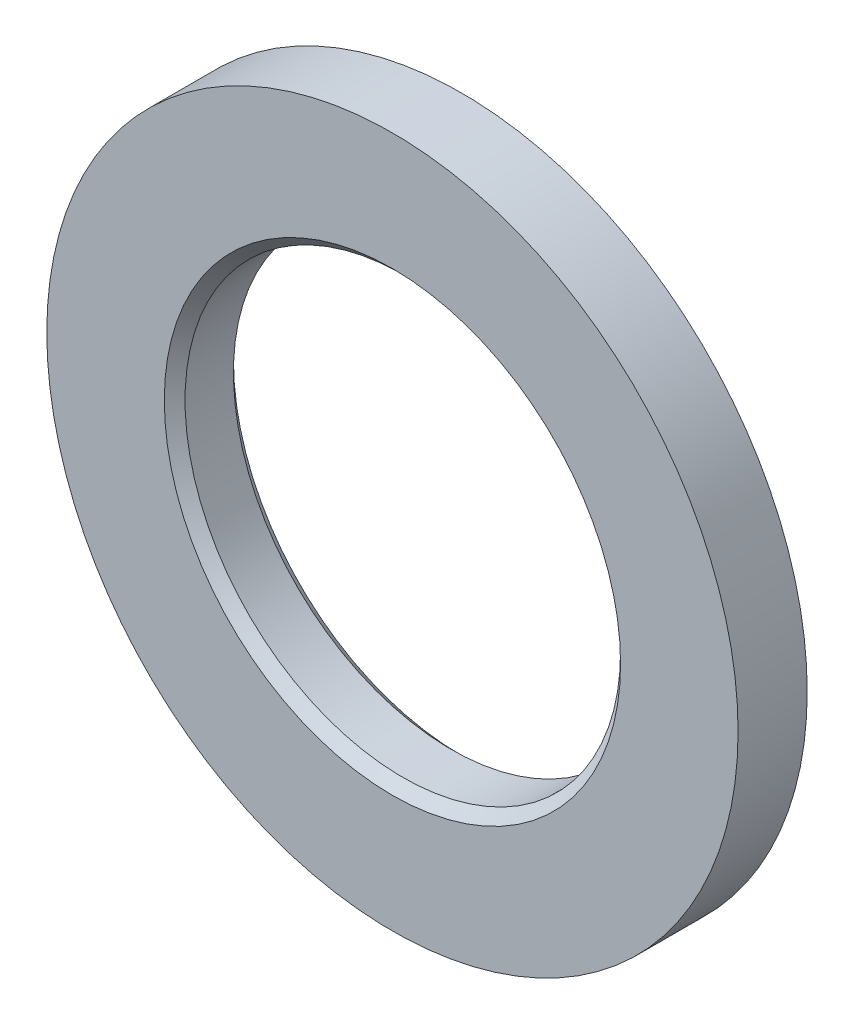
ISO-10303-21;
HEADER;
FILE_DESCRIPTION(('STEP AP214'),'2;1');
FILE_NAME('part.step','',(''),(''),'','','');
FILE_SCHEMA(('AUTOMOTIVE_DESIGN { 1 0 10303 214 1 1 1 1 }'));
ENDSEC;
DATA;
#1=APPLICATION_CONTEXT('core data for automotive mechanical design processes');
#2=APPLICATION_PROTOCOL_DEFINITION('international standard','automotive_design',2000,#1);
#3=PRODUCT_CONTEXT('',#1,'mechanical');
#4=PRODUCT('Part','Part','',(#3));
#5=PRODUCT_RELATED_PRODUCT_CATEGORY('part','',(#4));
#6=PRODUCT_DEFINITION_FORMATION('','',#4);
#7=PRODUCT_DEFINITION_CONTEXT('part definition',#1,'design');
#8=PRODUCT_DEFINITION('design','',#6,#7);
#9=PRODUCT_DEFINITION_SHAPE('','',#8);
#10=(LENGTH_UNIT() NAMED_UNIT(*) SI_UNIT(.MILLI.,.METRE.));
#11=(NAMED_UNIT(*) PLANE_ANGLE_UNIT() SI_UNIT($,.RADIAN.));
#12=(NAMED_UNIT(*) SI_UNIT($,.STERADIAN.) SOLID_ANGLE_UNIT());
#13=UNCERTAINTY_MEASURE_WITH_UNIT(LENGTH_MEASURE(1.E-05),#10,'distance_accuracy_value','');
#14=(GEOMETRIC_REPRESENTATION_CONTEXT(3) GLOBAL_UNCERTAINTY_ASSIGNED_CONTEXT((#13)) GLOBAL_UNIT_ASSIGNED_CONTEXT((#10,
#11,#12)) REPRESENTATION_CONTEXT('',''));
#15=CARTESIAN_POINT('',(0.,0.,0.));
#16=DIRECTION('',(0.,0.,1.));
#17=DIRECTION('',(1.,0.,0.));
#18=AXIS2_PLACEMENT_3D('',#15,#16,#17);
#19=CARTESIAN_POINT('',(0.,0.,5.));
#20=DIRECTION('',(0.,0.,-1.));
#21=DIRECTION('',(-1.,0.,0.));
#22=AXIS2_PLACEMENT_3D('',#19,#20,#21);
#23=CYLINDRICAL_SURFACE('',#22,25.);
#24=CARTESIAN_POINT('',(0.,0.,5.));
#25=DIRECTION('',(0.,0.,1.));
#26=DIRECTION('',(1.,0.,0.));
#27=AXIS2_PLACEMENT_3D('',#24,#25,#26);
#28=CIRCLE('',#27,25.);
#29=CARTESIAN_POINT('',(25.,0.,5.));
#30=VERTEX_POINT('',#29);
#31=EDGE_CURVE('E10',#30,#30,#28,.T.);
#32=ORIENTED_EDGE('',*,*,#31,.F.);
#33=EDGE_LOOP('',(#32));
#34=FACE_BOUND('',#33,.T.);
#35=CARTESIAN_POINT('',(0.,0.,0.));
#36=DIRECTION('',(0.,0.,1.));
#37=DIRECTION('',(1.,0.,0.));
#38=AXIS2_PLACEMENT_3D('',#35,#36,#37);
#39=CIRCLE('',#38,25.);
#40=CARTESIAN_POINT('',(25.,0.,0.));
#41=VERTEX_POINT('',#40);
#42=EDGE_CURVE('E36',#41,#41,#39,.T.);
#43=ORIENTED_EDGE('',*,*,#42,.T.);
#44=EDGE_LOOP('',(#43));
#45=FACE_BOUND('',#44,.T.);
#46=ADVANCED_FACE('F33',(#34,#45),#23,.T.);
#47=CARTESIAN_POINT('',(0.,0.,5.));
#48=DIRECTION('',(0.,0.,1.));
#49=DIRECTION('',(1.,0.,0.));
#50=AXIS2_PLACEMENT_3D('',#47,#48,#49);
#51=PLANE('',#50);
#52=CARTESIAN_POINT('',(0.,0.,5.));
#53=DIRECTION('',(0.,0.,1.));
#54=DIRECTION('',(1.,0.,0.));
#55=AXIS2_PLACEMENT_3D('',#52,#53,#54);
#56=CIRCLE('',#55,16.5);
#57=CARTESIAN_POINT('',(16.5,0.,5.));
#58=VERTEX_POINT('',#57);
#59=EDGE_CURVE('E43',#58,#58,#56,.T.);
#60=ORIENTED_EDGE('',*,*,#59,.F.);
#61=EDGE_LOOP('',(#60));
#62=FACE_BOUND('',#61,.T.);
#63=ORIENTED_EDGE('',*,*,#31,.T.);
#64=EDGE_LOOP('',(#63));
#65=FACE_BOUND('',#64,.T.);
#66=ADVANCED_FACE('F78',(#62,#65),#51,.T.);
#67=CARTESIAN_POINT('',(0.,0.,0.));
#68=DIRECTION('',(0.,0.,1.));
#69=DIRECTION('',(1.,0.,0.));
#70=AXIS2_PLACEMENT_3D('',#67,#68,#69);
#71=PLANE('',#70);
#72=CARTESIAN_POINT('',(0.,0.,0.));
#73=DIRECTION('',(0.,0.,1.));
#74=DIRECTION('',(1.,0.,0.));
#75=AXIS2_PLACEMENT_3D('',#72,#73,#74);
#76=CIRCLE('',#75,16.5);
#77=CARTESIAN_POINT('',(16.5,0.,0.));
#78=VERTEX_POINT('',#77);
#79=EDGE_CURVE('E53',#78,#78,#76,.T.);
#80=ORIENTED_EDGE('',*,*,#79,.T.);
#81=EDGE_LOOP('',(#80));
#82=FACE_BOUND('',#81,.T.);
#83=ORIENTED_EDGE('',*,*,#42,.F.);
#84=EDGE_LOOP('',(#83));
#85=FACE_BOUND('',#84,.T.);
#86=ADVANCED_FACE('F57',(#82,#85),#71,.F.);
#87=CARTESIAN_POINT('',(0.,0.,0.));
#88=DIRECTION('',(0.,0.,1.));
#89=DIRECTION('',(1.,0.,0.));
#90=AXIS2_PLACEMENT_3D('',#87,#88,#89);
#91=CYLINDRICAL_SURFACE('',#90,15.75);
#92=CARTESIAN_POINT('',(0.,0.,0.750000000000001));
#93=DIRECTION('',(0.,0.,1.));
#94=DIRECTION('',(1.,0.,0.));
#95=AXIS2_PLACEMENT_3D('',#92,#93,#94);
#96=CIRCLE('',#95,15.75);
#97=CARTESIAN_POINT('',(15.75,0.,0.750000000000001));
#98=VERTEX_POINT('',#97);
#99=EDGE_CURVE('E50',#98,#98,#96,.T.);
#100=ORIENTED_EDGE('',*,*,#99,.F.);
#101=EDGE_LOOP('',(#100));
#102=FACE_BOUND('',#101,.T.);
#103=CARTESIAN_POINT('',(0.,0.,4.25));
#104=DIRECTION('',(0.,0.,1.));
#105=DIRECTION('',(1.,0.,0.));
#106=AXIS2_PLACEMENT_3D('',#103,#104,#105);
#107=CIRCLE('',#106,15.75);
#108=CARTESIAN_POINT('',(15.75,0.,4.25));
#109=VERTEX_POINT('',#108);
#110=EDGE_CURVE('E47',#109,#109,#107,.T.);
#111=ORIENTED_EDGE('',*,*,#110,.T.);
#112=EDGE_LOOP('',(#111));
#113=FACE_BOUND('',#112,.T.);
#114=ADVANCED_FACE('F67',(#102,#113),#91,.F.);
#115=CARTESIAN_POINT('',(0.,0.,5.));
#116=DIRECTION('',(0.,0.,1.));
#117=DIRECTION('',(1.,0.,0.));
#118=AXIS2_PLACEMENT_3D('',#115,#116,#117);
#119=CONICAL_SURFACE('',#118,16.5,0.785398163397449);
#120=ORIENTED_EDGE('',*,*,#110,.F.);
#121=EDGE_LOOP('',(#120));
#122=FACE_BOUND('',#121,.T.);
#123=ORIENTED_EDGE('',*,*,#59,.T.);
#124=EDGE_LOOP('',(#123));
#125=FACE_BOUND('',#124,.T.);
#126=ADVANCED_FACE('F63',(#122,#125),#119,.F.);
#127=CARTESIAN_POINT('',(0.,0.,0.750000000000001));
#128=DIRECTION('',(0.,0.,-1.));
#129=DIRECTION('',(-1.,0.,0.));
#130=AXIS2_PLACEMENT_3D('',#127,#128,#129);
#131=CONICAL_SURFACE('',#130,15.75,0.785398163397448);
#132=ORIENTED_EDGE('',*,*,#79,.F.);
#133=EDGE_LOOP('',(#132));
#134=FACE_BOUND('',#133,.T.);
#135=ORIENTED_EDGE('',*,*,#99,.T.);
#136=EDGE_LOOP('',(#135));
#137=FACE_BOUND('',#136,.T.);
#138=ADVANCED_FACE('F60',(#134,#137),#131,.F.);
#139=CLOSED_SHELL('',(#46,#66,#86,#114,#126,#138));
#140=MANIFOLD_SOLID_BREP('B2',#139);
#141=ADVANCED_BREP_SHAPE_REPRESENTATION('',(#18,#140),#14);
#142=SHAPE_DEFINITION_REPRESENTATION(#9,#141);
ENDSEC;
END-ISO-10303-21;
